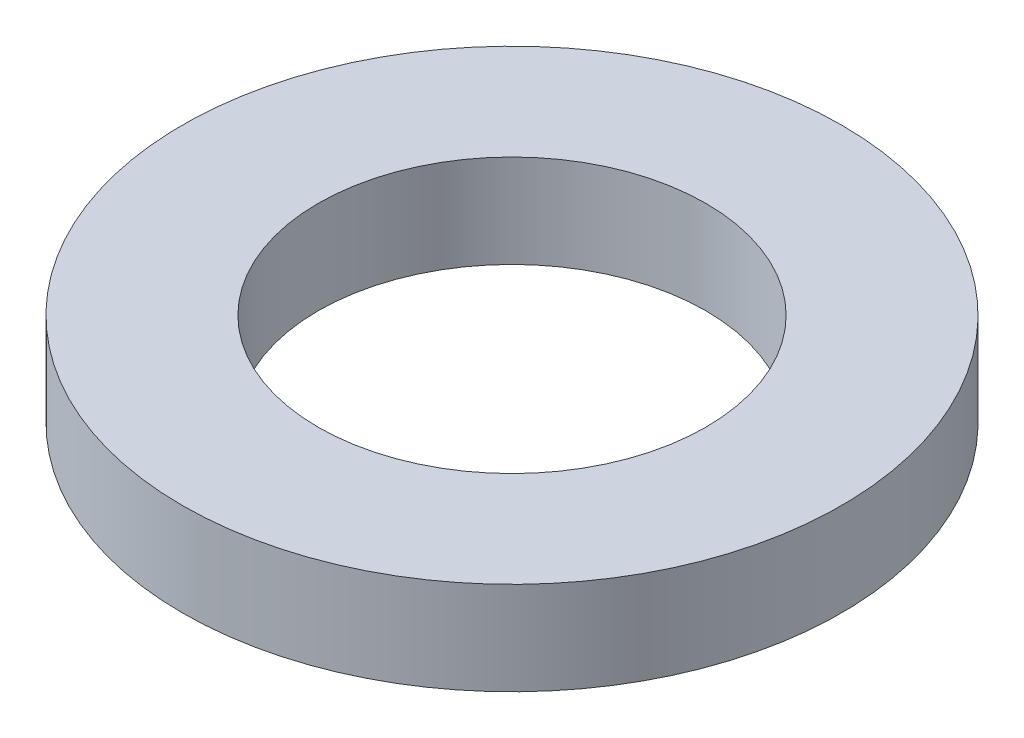
ISO-10303-21;
HEADER;
FILE_DESCRIPTION(('STEP AP214'),'2;1');
FILE_NAME('part.step','',(''),(''),'','','');
FILE_SCHEMA(('AUTOMOTIVE_DESIGN { 1 0 10303 214 1 1 1 1 }'));
ENDSEC;
DATA;
#1=APPLICATION_CONTEXT('core data for automotive mechanical design processes');
#2=APPLICATION_PROTOCOL_DEFINITION('international standard','automotive_design',2000,#1);
#3=PRODUCT_CONTEXT('',#1,'mechanical');
#4=PRODUCT('Part','Part','',(#3));
#5=PRODUCT_RELATED_PRODUCT_CATEGORY('part','',(#4));
#6=PRODUCT_DEFINITION_FORMATION('','',#4);
#7=PRODUCT_DEFINITION_CONTEXT('part definition',#1,'design');
#8=PRODUCT_DEFINITION('design','',#6,#7);
#9=PRODUCT_DEFINITION_SHAPE('','',#8);
#10=(LENGTH_UNIT() NAMED_UNIT(*) SI_UNIT(.MILLI.,.METRE.));
#11=(NAMED_UNIT(*) PLANE_ANGLE_UNIT() SI_UNIT($,.RADIAN.));
#12=(NAMED_UNIT(*) SI_UNIT($,.STERADIAN.) SOLID_ANGLE_UNIT());
#13=UNCERTAINTY_MEASURE_WITH_UNIT(LENGTH_MEASURE(1.E-05),#10,'distance_accuracy_value','');
#14=(GEOMETRIC_REPRESENTATION_CONTEXT(3) GLOBAL_UNCERTAINTY_ASSIGNED_CONTEXT((#13)) GLOBAL_UNIT_ASSIGNED_CONTEXT((#10,
#11,#12)) REPRESENTATION_CONTEXT('',''));
#15=CARTESIAN_POINT('',(0.,0.,0.));
#16=DIRECTION('',(0.,0.,1.));
#17=DIRECTION('',(1.,0.,0.));
#18=AXIS2_PLACEMENT_3D('',#15,#16,#17);
#19=CARTESIAN_POINT('',(0.,24.,0.));
#20=DIRECTION('',(0.,-1.,0.));
#21=DIRECTION('',(0.,0.,-1.));
#22=AXIS2_PLACEMENT_3D('',#19,#20,#21);
#23=CYLINDRICAL_SURFACE('',#22,85.);
#24=CARTESIAN_POINT('',(0.,24.,0.));
#25=DIRECTION('',(0.,1.,0.));
#26=DIRECTION('',(0.,0.,1.));
#27=AXIS2_PLACEMENT_3D('',#24,#25,#26);
#28=CIRCLE('',#27,85.);
#29=CARTESIAN_POINT('',(0.,24.,85.));
#30=VERTEX_POINT('',#29);
#31=EDGE_CURVE('E10',#30,#30,#28,.T.);
#32=ORIENTED_EDGE('',*,*,#31,.F.);
#33=EDGE_LOOP('',(#32));
#34=FACE_BOUND('',#33,.T.);
#35=CARTESIAN_POINT('',(0.,0.,0.));
#36=DIRECTION('',(0.,1.,0.));
#37=DIRECTION('',(0.,0.,1.));
#38=AXIS2_PLACEMENT_3D('',#35,#36,#37);
#39=CIRCLE('',#38,85.);
#40=CARTESIAN_POINT('',(0.,0.,85.));
#41=VERTEX_POINT('',#40);
#42=EDGE_CURVE('E37',#41,#41,#39,.T.);
#43=ORIENTED_EDGE('',*,*,#42,.T.);
#44=EDGE_LOOP('',(#43));
#45=FACE_BOUND('',#44,.T.);
#46=ADVANCED_FACE('F40',(#34,#45),#23,.T.);
#47=CARTESIAN_POINT('',(0.,24.,0.));
#48=DIRECTION('',(0.,1.,0.));
#49=DIRECTION('',(0.,0.,1.));
#50=AXIS2_PLACEMENT_3D('',#47,#48,#49);
#51=PLANE('',#50);
#52=CARTESIAN_POINT('',(0.,24.,0.));
#53=DIRECTION('',(0.,1.,0.));
#54=DIRECTION('',(0.,0.,1.));
#55=AXIS2_PLACEMENT_3D('',#52,#53,#54);
#56=CIRCLE('',#55,50.);
#57=CARTESIAN_POINT('',(0.,24.,50.));
#58=VERTEX_POINT('',#57);
#59=EDGE_CURVE('E50',#58,#58,#56,.T.);
#60=ORIENTED_EDGE('',*,*,#59,.F.);
#61=EDGE_LOOP('',(#60));
#62=FACE_BOUND('',#61,.T.);
#63=ORIENTED_EDGE('',*,*,#31,.T.);
#64=EDGE_LOOP('',(#63));
#65=FACE_BOUND('',#64,.T.);
#66=ADVANCED_FACE('F59',(#62,#65),#51,.T.);
#67=CARTESIAN_POINT('',(0.,0.,0.));
#68=DIRECTION('',(0.,1.,0.));
#69=DIRECTION('',(0.,0.,1.));
#70=AXIS2_PLACEMENT_3D('',#67,#68,#69);
#71=PLANE('',#70);
#72=CARTESIAN_POINT('',(0.,0.,0.));
#73=DIRECTION('',(0.,1.,0.));
#74=DIRECTION('',(0.,0.,1.));
#75=AXIS2_PLACEMENT_3D('',#72,#73,#74);
#76=CIRCLE('',#75,50.);
#77=CARTESIAN_POINT('',(0.,0.,50.));
#78=VERTEX_POINT('',#77);
#79=EDGE_CURVE('E47',#78,#78,#76,.T.);
#80=ORIENTED_EDGE('',*,*,#79,.T.);
#81=EDGE_LOOP('',(#80));
#82=FACE_BOUND('',#81,.T.);
#83=ORIENTED_EDGE('',*,*,#42,.F.);
#84=EDGE_LOOP('',(#83));
#85=FACE_BOUND('',#84,.T.);
#86=ADVANCED_FACE('F58',(#82,#85),#71,.F.);
#87=CARTESIAN_POINT('',(0.,24.,0.));
#88=DIRECTION('',(0.,-1.,0.));
#89=DIRECTION('',(0.,0.,-1.));
#90=AXIS2_PLACEMENT_3D('',#87,#88,#89);
#91=CYLINDRICAL_SURFACE('',#90,50.);
#92=ORIENTED_EDGE('',*,*,#59,.T.);
#93=EDGE_LOOP('',(#92));
#94=FACE_BOUND('',#93,.T.);
#95=ORIENTED_EDGE('',*,*,#79,.F.);
#96=EDGE_LOOP('',(#95));
#97=FACE_BOUND('',#96,.T.);
#98=ADVANCED_FACE('F54',(#94,#97),#91,.F.);
#99=CLOSED_SHELL('',(#46,#66,#86,#98));
#100=MANIFOLD_SOLID_BREP('B2',#99);
#101=ADVANCED_BREP_SHAPE_REPRESENTATION('',(#18,#100),#14);
#102=SHAPE_DEFINITION_REPRESENTATION(#9,#101);
ENDSEC;
END-ISO-10303-21;
